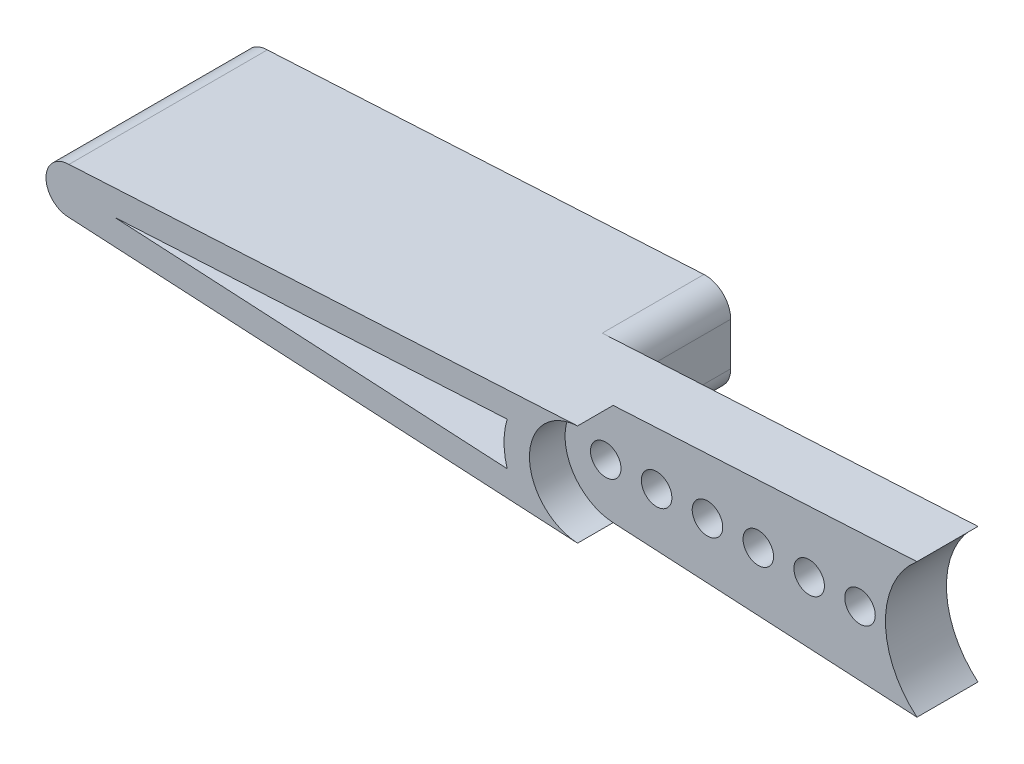
ISO-10303-21;
HEADER;
FILE_DESCRIPTION(('STEP AP214'),'2;1');
FILE_NAME('part.step','',(''),(''),'','','');
FILE_SCHEMA(('AUTOMOTIVE_DESIGN { 1 0 10303 214 1 1 1 1 }'));
ENDSEC;
DATA;
#1=APPLICATION_CONTEXT('core data for automotive mechanical design processes');
#2=APPLICATION_PROTOCOL_DEFINITION('international standard','automotive_design',2000,#1);
#3=PRODUCT_CONTEXT('',#1,'mechanical');
#4=PRODUCT('Part','Part','',(#3));
#5=PRODUCT_RELATED_PRODUCT_CATEGORY('part','',(#4));
#6=PRODUCT_DEFINITION_FORMATION('','',#4);
#7=PRODUCT_DEFINITION_CONTEXT('part definition',#1,'design');
#8=PRODUCT_DEFINITION('design','',#6,#7);
#9=PRODUCT_DEFINITION_SHAPE('','',#8);
#10=(LENGTH_UNIT() NAMED_UNIT(*) SI_UNIT(.MILLI.,.METRE.));
#11=(NAMED_UNIT(*) PLANE_ANGLE_UNIT() SI_UNIT($,.RADIAN.));
#12=(NAMED_UNIT(*) SI_UNIT($,.STERADIAN.) SOLID_ANGLE_UNIT());
#13=UNCERTAINTY_MEASURE_WITH_UNIT(LENGTH_MEASURE(1.E-05),#10,'distance_accuracy_value','');
#14=(GEOMETRIC_REPRESENTATION_CONTEXT(3) GLOBAL_UNCERTAINTY_ASSIGNED_CONTEXT((#13)) GLOBAL_UNIT_ASSIGNED_CONTEXT((#10,
#11,#12)) REPRESENTATION_CONTEXT('',''));
#15=CARTESIAN_POINT('',(0.,0.,0.));
#16=DIRECTION('',(0.,0.,1.));
#17=DIRECTION('',(1.,0.,0.));
#18=AXIS2_PLACEMENT_3D('',#15,#16,#17);
#19=CARTESIAN_POINT('',(0.,0.,0.));
#20=DIRECTION('',(0.,0.,1.));
#21=DIRECTION('',(1.,0.,0.));
#22=AXIS2_PLACEMENT_3D('',#19,#20,#21);
#23=PLANE('',#22);
#24=CARTESIAN_POINT('',(-11.,0.,0.));
#25=DIRECTION('',(0.,0.,1.));
#26=DIRECTION('',(1.,0.,0.));
#27=AXIS2_PLACEMENT_3D('',#24,#25,#26);
#28=CIRCLE('',#27,0.600000000000013);
#29=CARTESIAN_POINT('',(-10.4,0.,0.));
#30=VERTEX_POINT('',#29);
#31=EDGE_CURVE('E311',#30,#30,#28,.T.);
#32=ORIENTED_EDGE('',*,*,#31,.T.);
#33=EDGE_LOOP('',(#32));
#34=FACE_BOUND('',#33,.T.);
#35=CARTESIAN_POINT('',(-9.,0.,0.));
#36=DIRECTION('',(0.,0.,1.));
#37=DIRECTION('',(1.,0.,0.));
#38=AXIS2_PLACEMENT_3D('',#35,#36,#37);
#39=CIRCLE('',#38,0.600000000000013);
#40=CARTESIAN_POINT('',(-8.39999999999999,0.,0.));
#41=VERTEX_POINT('',#40);
#42=EDGE_CURVE('E307',#41,#41,#39,.T.);
#43=ORIENTED_EDGE('',*,*,#42,.T.);
#44=EDGE_LOOP('',(#43));
#45=FACE_BOUND('',#44,.T.);
#46=CARTESIAN_POINT('',(-7.,0.,0.));
#47=DIRECTION('',(0.,0.,1.));
#48=DIRECTION('',(1.,0.,0.));
#49=AXIS2_PLACEMENT_3D('',#46,#47,#48);
#50=CIRCLE('',#49,0.600000000000013);
#51=CARTESIAN_POINT('',(-6.39999999999999,0.,0.));
#52=VERTEX_POINT('',#51);
#53=EDGE_CURVE('E303',#52,#52,#50,.T.);
#54=ORIENTED_EDGE('',*,*,#53,.T.);
#55=EDGE_LOOP('',(#54));
#56=FACE_BOUND('',#55,.T.);
#57=CARTESIAN_POINT('',(-5.,0.,0.));
#58=DIRECTION('',(0.,0.,1.));
#59=DIRECTION('',(1.,0.,0.));
#60=AXIS2_PLACEMENT_3D('',#57,#58,#59);
#61=CIRCLE('',#60,0.600000000000013);
#62=CARTESIAN_POINT('',(-4.39999999999999,0.,0.));
#63=VERTEX_POINT('',#62);
#64=EDGE_CURVE('E299',#63,#63,#61,.T.);
#65=ORIENTED_EDGE('',*,*,#64,.T.);
#66=EDGE_LOOP('',(#65));
#67=FACE_BOUND('',#66,.T.);
#68=CARTESIAN_POINT('',(-3.,0.,0.));
#69=DIRECTION('',(0.,0.,1.));
#70=DIRECTION('',(1.,0.,0.));
#71=AXIS2_PLACEMENT_3D('',#68,#69,#70);
#72=CIRCLE('',#71,0.600000000000013);
#73=CARTESIAN_POINT('',(-2.39999999999999,0.,0.));
#74=VERTEX_POINT('',#73);
#75=EDGE_CURVE('E295',#74,#74,#72,.T.);
#76=ORIENTED_EDGE('',*,*,#75,.T.);
#77=EDGE_LOOP('',(#76));
#78=FACE_BOUND('',#77,.T.);
#79=CARTESIAN_POINT('',(-0.999999999999999,0.,0.));
#80=DIRECTION('',(0.,0.,1.));
#81=DIRECTION('',(1.,0.,0.));
#82=AXIS2_PLACEMENT_3D('',#79,#80,#81);
#83=CIRCLE('',#82,0.600000000000013);
#84=CARTESIAN_POINT('',(-0.399999999999986,0.,0.));
#85=VERTEX_POINT('',#84);
#86=EDGE_CURVE('E148',#85,#85,#83,.T.);
#87=ORIENTED_EDGE('',*,*,#86,.T.);
#88=EDGE_LOOP('',(#87));
#89=FACE_BOUND('',#88,.T.);
#90=DIRECTION('',(0.,1.,0.));
#91=VECTOR('',#90,1.);
#92=CARTESIAN_POINT('',(-12.4846831030102,0.,0.));
#93=LINE('',#92,#91);
#94=CARTESIAN_POINT('',(-12.4846831030102,-0.843865841434121,0.));
#95=VERTEX_POINT('',#94);
#96=CARTESIAN_POINT('',(-12.4846831030102,0.84386584143412,0.));
#97=VERTEX_POINT('',#96);
#98=EDGE_CURVE('E57',#95,#97,#93,.T.);
#99=ORIENTED_EDGE('',*,*,#98,.T.);
#100=CARTESIAN_POINT('',(-13.4846831030102,0.84386584143412,0.));
#101=DIRECTION('',(0.,0.,-1.));
#102=DIRECTION('',(-1.,0.,0.));
#103=AXIS2_PLACEMENT_3D('',#100,#101,#102);
#104=CIRCLE('',#103,1.);
#105=CARTESIAN_POINT('',(-13.5392440865313,1.84237628157844,0.));
#106=VERTEX_POINT('',#105);
#107=EDGE_CURVE('E165',#97,#106,#104,.F.);
#108=ORIENTED_EDGE('',*,*,#107,.T.);
#109=DIRECTION('',(-0.998510440144325,-0.0545609835210726,0.));
#110=VECTOR('',#109,1.);
#111=CARTESIAN_POINT('',(-0.140677116823685,2.57450582399418,0.));
#112=LINE('',#111,#110);
#113=CARTESIAN_POINT('',(1.24092779656255,2.65,0.));
#114=VERTEX_POINT('',#113);
#115=EDGE_CURVE('E315',#114,#106,#112,.T.);
#116=ORIENTED_EDGE('',*,*,#115,.F.);
#117=CARTESIAN_POINT('',(3.45,0.,0.));
#118=DIRECTION('',(0.,0.,1.));
#119=DIRECTION('',(1.,0.,0.));
#120=AXIS2_PLACEMENT_3D('',#117,#118,#119);
#121=CIRCLE('',#120,3.45);
#122=CARTESIAN_POINT('',(1.24092779656255,-2.65,0.));
#123=VERTEX_POINT('',#122);
#124=EDGE_CURVE('E259',#114,#123,#121,.T.);
#125=ORIENTED_EDGE('',*,*,#124,.T.);
#126=DIRECTION('',(0.998510440144325,-0.0545609835210729,0.));
#127=VECTOR('',#126,1.);
#128=CARTESIAN_POINT('',(-0.140677116823685,-2.57450582399419,0.));
#129=LINE('',#128,#127);
#130=CARTESIAN_POINT('',(-13.5392440865313,-1.84237628157844,0.));
#131=VERTEX_POINT('',#130);
#132=EDGE_CURVE('E319',#131,#123,#129,.T.);
#133=ORIENTED_EDGE('',*,*,#132,.F.);
#134=CARTESIAN_POINT('',(-13.4846831030102,-0.843865841434122,0.));
#135=DIRECTION('',(0.,0.,-1.));
#136=DIRECTION('',(-1.,0.,0.));
#137=AXIS2_PLACEMENT_3D('',#134,#135,#136);
#138=CIRCLE('',#137,1.);
#139=EDGE_CURVE('E62',#95,#131,#138,.T.);
#140=ORIENTED_EDGE('',*,*,#139,.F.);
#141=EDGE_LOOP('',(#99,#108,#116,#125,#133,#140));
#142=FACE_BOUND('',#141,.T.);
#143=ADVANCED_FACE('F41',(#34,#45,#56,#67,#78,#89,#142),#23,.F.);
#144=CARTESIAN_POINT('',(-0.140677116823685,2.57450582399418,2.4));
#145=DIRECTION('',(0.0545609835210726,-0.998510440144325,0.));
#146=DIRECTION('',(0.998510440144325,0.0545609835210726,0.));
#147=AXIS2_PLACEMENT_3D('',#144,#145,#146);
#148=PLANE('',#147);
#149=ORIENTED_EDGE('',*,*,#115,.T.);
#150=DIRECTION('',(0.,0.,1.));
#151=VECTOR('',#150,1.);
#152=CARTESIAN_POINT('',(-13.5392440865313,1.84237628157844,-4.));
#153=LINE('',#152,#151);
#154=CARTESIAN_POINT('',(-13.5392440865313,1.84237628157844,-4.));
#155=VERTEX_POINT('',#154);
#156=EDGE_CURVE('E202',#155,#106,#153,.T.);
#157=ORIENTED_EDGE('',*,*,#156,.F.);
#158=DIRECTION('',(0.998510440144325,0.0545609835210726,0.));
#159=VECTOR('',#158,1.);
#160=CARTESIAN_POINT('',(-0.140677116823685,2.57450582399418,-4.));
#161=LINE('',#160,#159);
#162=CARTESIAN_POINT('',(-30.7114062880559,0.904048527325677,-4.));
#163=VERTEX_POINT('',#162);
#164=EDGE_CURVE('E188',#163,#155,#161,.T.);
#165=ORIENTED_EDGE('',*,*,#164,.F.);
#166=DIRECTION('',(0.,0.,-1.));
#167=VECTOR('',#166,1.);
#168=CARTESIAN_POINT('',(-30.7114062880559,0.904048527325677,3.8));
#169=LINE('',#168,#167);
#170=CARTESIAN_POINT('',(-30.7114062880559,0.904048527325677,3.8));
#171=VERTEX_POINT('',#170);
#172=EDGE_CURVE('E239',#171,#163,#169,.T.);
#173=ORIENTED_EDGE('',*,*,#172,.F.);
#174=DIRECTION('',(-0.998510440144325,-0.0545609835210725,0.));
#175=VECTOR('',#174,1.);
#176=CARTESIAN_POINT('',(-0.140677116823685,2.57450582399418,3.8));
#177=LINE('',#176,#175);
#178=CARTESIAN_POINT('',(-10.7091219670421,1.99702088028865,3.8));
#179=VERTEX_POINT('',#178);
#180=EDGE_CURVE('E213',#179,#171,#177,.T.);
#181=ORIENTED_EDGE('',*,*,#180,.F.);
#182=DIRECTION('',(0.,0.,-1.));
#183=VECTOR('',#182,1.);
#184=CARTESIAN_POINT('',(-10.7091219670421,1.99702088028865,3.8));
#185=LINE('',#184,#183);
#186=CARTESIAN_POINT('',(-10.7091219670421,1.99702088028865,2.4));
#187=VERTEX_POINT('',#186);
#188=EDGE_CURVE('E236',#179,#187,#185,.T.);
#189=ORIENTED_EDGE('',*,*,#188,.T.);
#190=DIRECTION('',(-0.998510440144325,-0.0545609835210726,0.));
#191=VECTOR('',#190,1.);
#192=CARTESIAN_POINT('',(-0.140677116823685,2.57450582399418,2.4));
#193=LINE('',#192,#191);
#194=CARTESIAN_POINT('',(1.24092779656255,2.65,2.4));
#195=VERTEX_POINT('',#194);
#196=EDGE_CURVE('E279',#195,#187,#193,.T.);
#197=ORIENTED_EDGE('',*,*,#196,.F.);
#198=DIRECTION('',(0.,0.,-1.));
#199=VECTOR('',#198,1.);
#200=CARTESIAN_POINT('',(1.24092779656255,2.65,2.4));
#201=LINE('',#200,#199);
#202=EDGE_CURVE('E50',#195,#114,#201,.T.);
#203=ORIENTED_EDGE('',*,*,#202,.T.);
#204=EDGE_LOOP('',(#149,#157,#165,#173,#181,#189,#197,#203));
#205=FACE_BOUND('',#204,.T.);
#206=ADVANCED_FACE('F328',(#205),#148,.F.);
#207=CARTESIAN_POINT('',(-0.140677116823685,-2.57450582399419,2.4));
#208=DIRECTION('',(0.0545609835210728,0.998510440144325,0.));
#209=DIRECTION('',(-0.998510440144325,0.0545609835210728,0.));
#210=AXIS2_PLACEMENT_3D('',#207,#208,#209);
#211=PLANE('',#210);
#212=DIRECTION('',(0.,0.,-1.));
#213=VECTOR('',#212,1.);
#214=CARTESIAN_POINT('',(-30.7114062880559,-0.904048527325679,3.8));
#215=LINE('',#214,#213);
#216=CARTESIAN_POINT('',(-30.7114062880559,-0.904048527325679,3.8));
#217=VERTEX_POINT('',#216);
#218=CARTESIAN_POINT('',(-30.7114062880559,-0.904048527325678,-4.));
#219=VERTEX_POINT('',#218);
#220=EDGE_CURVE('E249',#217,#219,#215,.T.);
#221=ORIENTED_EDGE('',*,*,#220,.T.);
#222=DIRECTION('',(-0.998510440144325,0.0545609835210729,0.));
#223=VECTOR('',#222,1.);
#224=CARTESIAN_POINT('',(-0.140677116823685,-2.57450582399419,-4.));
#225=LINE('',#224,#223);
#226=CARTESIAN_POINT('',(-13.5392440865313,-1.84237628157844,-4.));
#227=VERTEX_POINT('',#226);
#228=EDGE_CURVE('E180',#227,#219,#225,.T.);
#229=ORIENTED_EDGE('',*,*,#228,.F.);
#230=DIRECTION('',(0.,0.,1.));
#231=VECTOR('',#230,1.);
#232=CARTESIAN_POINT('',(-13.5392440865313,-1.84237628157844,-4.));
#233=LINE('',#232,#231);
#234=EDGE_CURVE('E206',#227,#131,#233,.T.);
#235=ORIENTED_EDGE('',*,*,#234,.T.);
#236=ORIENTED_EDGE('',*,*,#132,.T.);
#237=DIRECTION('',(0.,0.,-1.));
#238=VECTOR('',#237,1.);
#239=CARTESIAN_POINT('',(1.24092779656255,-2.65,2.4));
#240=LINE('',#239,#238);
#241=CARTESIAN_POINT('',(1.24092779656255,-2.65,2.4));
#242=VERTEX_POINT('',#241);
#243=EDGE_CURVE('E11',#242,#123,#240,.T.);
#244=ORIENTED_EDGE('',*,*,#243,.F.);
#245=DIRECTION('',(0.998510440144325,-0.0545609835210729,0.));
#246=VECTOR('',#245,1.);
#247=CARTESIAN_POINT('',(-0.140677116823685,-2.57450582399419,2.4));
#248=LINE('',#247,#246);
#249=CARTESIAN_POINT('',(-10.7091219670421,-1.99702088028865,2.4));
#250=VERTEX_POINT('',#249);
#251=EDGE_CURVE('E285',#250,#242,#248,.T.);
#252=ORIENTED_EDGE('',*,*,#251,.F.);
#253=DIRECTION('',(0.,0.,-1.));
#254=VECTOR('',#253,1.);
#255=CARTESIAN_POINT('',(-10.7091219670421,-1.99702088028865,3.8));
#256=LINE('',#255,#254);
#257=CARTESIAN_POINT('',(-10.7091219670421,-1.99702088028865,3.8));
#258=VERTEX_POINT('',#257);
#259=EDGE_CURVE('E245',#258,#250,#256,.T.);
#260=ORIENTED_EDGE('',*,*,#259,.F.);
#261=DIRECTION('',(-0.998510440144325,0.0545609835210724,0.));
#262=VECTOR('',#261,1.);
#263=CARTESIAN_POINT('',(-0.140677116823684,-2.57450582399418,3.8));
#264=LINE('',#263,#262);
#265=EDGE_CURVE('E220',#258,#217,#264,.T.);
#266=ORIENTED_EDGE('',*,*,#265,.T.);
#267=EDGE_LOOP('',(#221,#229,#235,#236,#244,#252,#260,#266));
#268=FACE_BOUND('',#267,.T.);
#269=ADVANCED_FACE('F338',(#268),#211,.F.);
#270=CARTESIAN_POINT('',(-11.,0.,2.4));
#271=DIRECTION('',(0.,0.,-1.));
#272=DIRECTION('',(-1.,0.,0.));
#273=AXIS2_PLACEMENT_3D('',#270,#271,#272);
#274=CYLINDRICAL_SURFACE('',#273,0.600000000000013);
#275=CARTESIAN_POINT('',(-11.,0.,2.4));
#276=DIRECTION('',(0.,0.,1.));
#277=DIRECTION('',(1.,0.,0.));
#278=AXIS2_PLACEMENT_3D('',#275,#276,#277);
#279=CIRCLE('',#278,0.600000000000013);
#280=CARTESIAN_POINT('',(-10.4,0.,2.4));
#281=VERTEX_POINT('',#280);
#282=EDGE_CURVE('E275',#281,#281,#279,.T.);
#283=ORIENTED_EDGE('',*,*,#282,.T.);
#284=EDGE_LOOP('',(#283));
#285=FACE_BOUND('',#284,.T.);
#286=ORIENTED_EDGE('',*,*,#31,.F.);
#287=EDGE_LOOP('',(#286));
#288=FACE_BOUND('',#287,.T.);
#289=ADVANCED_FACE('F388',(#285,#288),#274,.F.);
#290=CARTESIAN_POINT('',(-9.,0.,2.4));
#291=DIRECTION('',(0.,0.,-1.));
#292=DIRECTION('',(-1.,0.,0.));
#293=AXIS2_PLACEMENT_3D('',#290,#291,#292);
#294=CYLINDRICAL_SURFACE('',#293,0.600000000000013);
#295=CARTESIAN_POINT('',(-9.,0.,2.4));
#296=DIRECTION('',(0.,0.,1.));
#297=DIRECTION('',(1.,0.,0.));
#298=AXIS2_PLACEMENT_3D('',#295,#296,#297);
#299=CIRCLE('',#298,0.600000000000013);
#300=CARTESIAN_POINT('',(-8.39999999999999,0.,2.4));
#301=VERTEX_POINT('',#300);
#302=EDGE_CURVE('E271',#301,#301,#299,.T.);
#303=ORIENTED_EDGE('',*,*,#302,.T.);
#304=EDGE_LOOP('',(#303));
#305=FACE_BOUND('',#304,.T.);
#306=ORIENTED_EDGE('',*,*,#42,.F.);
#307=EDGE_LOOP('',(#306));
#308=FACE_BOUND('',#307,.T.);
#309=ADVANCED_FACE('F392',(#305,#308),#294,.F.);
#310=CARTESIAN_POINT('',(-7.,0.,2.4));
#311=DIRECTION('',(0.,0.,-1.));
#312=DIRECTION('',(-1.,0.,0.));
#313=AXIS2_PLACEMENT_3D('',#310,#311,#312);
#314=CYLINDRICAL_SURFACE('',#313,0.600000000000013);
#315=CARTESIAN_POINT('',(-7.,0.,2.4));
#316=DIRECTION('',(0.,0.,1.));
#317=DIRECTION('',(1.,0.,0.));
#318=AXIS2_PLACEMENT_3D('',#315,#316,#317);
#319=CIRCLE('',#318,0.600000000000013);
#320=CARTESIAN_POINT('',(-6.39999999999999,0.,2.4));
#321=VERTEX_POINT('',#320);
#322=EDGE_CURVE('E267',#321,#321,#319,.T.);
#323=ORIENTED_EDGE('',*,*,#322,.T.);
#324=EDGE_LOOP('',(#323));
#325=FACE_BOUND('',#324,.T.);
#326=ORIENTED_EDGE('',*,*,#53,.F.);
#327=EDGE_LOOP('',(#326));
#328=FACE_BOUND('',#327,.T.);
#329=ADVANCED_FACE('F396',(#325,#328),#314,.F.);
#330=CARTESIAN_POINT('',(-5.,0.,2.4));
#331=DIRECTION('',(0.,0.,-1.));
#332=DIRECTION('',(-1.,0.,0.));
#333=AXIS2_PLACEMENT_3D('',#330,#331,#332);
#334=CYLINDRICAL_SURFACE('',#333,0.600000000000013);
#335=CARTESIAN_POINT('',(-5.,0.,2.4));
#336=DIRECTION('',(0.,0.,1.));
#337=DIRECTION('',(1.,0.,0.));
#338=AXIS2_PLACEMENT_3D('',#335,#336,#337);
#339=CIRCLE('',#338,0.600000000000013);
#340=CARTESIAN_POINT('',(-4.39999999999999,0.,2.4));
#341=VERTEX_POINT('',#340);
#342=EDGE_CURVE('E263',#341,#341,#339,.T.);
#343=ORIENTED_EDGE('',*,*,#342,.T.);
#344=EDGE_LOOP('',(#343));
#345=FACE_BOUND('',#344,.T.);
#346=ORIENTED_EDGE('',*,*,#64,.F.);
#347=EDGE_LOOP('',(#346));
#348=FACE_BOUND('',#347,.T.);
#349=ADVANCED_FACE('F400',(#345,#348),#334,.F.);
#350=CARTESIAN_POINT('',(-3.,0.,2.4));
#351=DIRECTION('',(0.,0.,-1.));
#352=DIRECTION('',(-1.,0.,0.));
#353=AXIS2_PLACEMENT_3D('',#350,#351,#352);
#354=CYLINDRICAL_SURFACE('',#353,0.600000000000013);
#355=CARTESIAN_POINT('',(-3.,0.,2.4));
#356=DIRECTION('',(0.,0.,1.));
#357=DIRECTION('',(1.,0.,0.));
#358=AXIS2_PLACEMENT_3D('',#355,#356,#357);
#359=CIRCLE('',#358,0.600000000000013);
#360=CARTESIAN_POINT('',(-2.39999999999999,0.,2.4));
#361=VERTEX_POINT('',#360);
#362=EDGE_CURVE('E258',#361,#361,#359,.T.);
#363=ORIENTED_EDGE('',*,*,#362,.T.);
#364=EDGE_LOOP('',(#363));
#365=FACE_BOUND('',#364,.T.);
#366=ORIENTED_EDGE('',*,*,#75,.F.);
#367=EDGE_LOOP('',(#366));
#368=FACE_BOUND('',#367,.T.);
#369=ADVANCED_FACE('F403',(#365,#368),#354,.F.);
#370=CARTESIAN_POINT('',(-0.999999999999999,0.,2.4));
#371=DIRECTION('',(0.,0.,-1.));
#372=DIRECTION('',(-1.,0.,0.));
#373=AXIS2_PLACEMENT_3D('',#370,#371,#372);
#374=CYLINDRICAL_SURFACE('',#373,0.600000000000013);
#375=CARTESIAN_POINT('',(-0.999999999999999,0.,2.4));
#376=DIRECTION('',(0.,0.,1.));
#377=DIRECTION('',(1.,0.,0.));
#378=AXIS2_PLACEMENT_3D('',#375,#376,#377);
#379=CIRCLE('',#378,0.600000000000013);
#380=CARTESIAN_POINT('',(-0.399999999999986,0.,2.4));
#381=VERTEX_POINT('',#380);
#382=EDGE_CURVE('E254',#381,#381,#379,.T.);
#383=ORIENTED_EDGE('',*,*,#382,.T.);
#384=EDGE_LOOP('',(#383));
#385=FACE_BOUND('',#384,.T.);
#386=ORIENTED_EDGE('',*,*,#86,.F.);
#387=EDGE_LOOP('',(#386));
#388=FACE_BOUND('',#387,.T.);
#389=ADVANCED_FACE('F43',(#385,#388),#374,.F.);
#390=CARTESIAN_POINT('',(3.45,0.,2.4));
#391=DIRECTION('',(0.,0.,-1.));
#392=DIRECTION('',(-1.,0.,0.));
#393=AXIS2_PLACEMENT_3D('',#390,#391,#392);
#394=CYLINDRICAL_SURFACE('',#393,3.45);
#395=ORIENTED_EDGE('',*,*,#124,.F.);
#396=ORIENTED_EDGE('',*,*,#202,.F.);
#397=CARTESIAN_POINT('',(3.45,0.,2.4));
#398=DIRECTION('',(0.,0.,1.));
#399=DIRECTION('',(1.,0.,0.));
#400=AXIS2_PLACEMENT_3D('',#397,#398,#399);
#401=CIRCLE('',#400,3.45);
#402=EDGE_CURVE('E288',#195,#242,#401,.T.);
#403=ORIENTED_EDGE('',*,*,#402,.T.);
#404=ORIENTED_EDGE('',*,*,#243,.T.);
#405=EDGE_LOOP('',(#395,#396,#403,#404));
#406=FACE_BOUND('',#405,.T.);
#407=ADVANCED_FACE('F334',(#406),#394,.F.);
#408=CARTESIAN_POINT('',(0.,0.,2.4));
#409=DIRECTION('',(0.,0.,1.));
#410=DIRECTION('',(1.,0.,0.));
#411=AXIS2_PLACEMENT_3D('',#408,#409,#410);
#412=PLANE('',#411);
#413=ORIENTED_EDGE('',*,*,#382,.F.);
#414=EDGE_LOOP('',(#413));
#415=FACE_BOUND('',#414,.T.);
#416=ORIENTED_EDGE('',*,*,#362,.F.);
#417=EDGE_LOOP('',(#416));
#418=FACE_BOUND('',#417,.T.);
#419=ORIENTED_EDGE('',*,*,#342,.F.);
#420=EDGE_LOOP('',(#419));
#421=FACE_BOUND('',#420,.T.);
#422=ORIENTED_EDGE('',*,*,#322,.F.);
#423=EDGE_LOOP('',(#422));
#424=FACE_BOUND('',#423,.T.);
#425=ORIENTED_EDGE('',*,*,#302,.F.);
#426=EDGE_LOOP('',(#425));
#427=FACE_BOUND('',#426,.T.);
#428=ORIENTED_EDGE('',*,*,#282,.F.);
#429=EDGE_LOOP('',(#428));
#430=FACE_BOUND('',#429,.T.);
#431=ORIENTED_EDGE('',*,*,#196,.T.);
#432=CARTESIAN_POINT('',(-10.6,0.,2.4));
#433=DIRECTION('',(0.,0.,1.));
#434=DIRECTION('',(1.,0.,0.));
#435=AXIS2_PLACEMENT_3D('',#432,#433,#434);
#436=CIRCLE('',#435,2.);
#437=EDGE_CURVE('E282',#187,#250,#436,.T.);
#438=ORIENTED_EDGE('',*,*,#437,.T.);
#439=ORIENTED_EDGE('',*,*,#251,.T.);
#440=ORIENTED_EDGE('',*,*,#402,.F.);
#441=EDGE_LOOP('',(#431,#438,#439,#440));
#442=FACE_BOUND('',#441,.T.);
#443=ADVANCED_FACE('F365',(#415,#418,#421,#424,#427,#430,#442),#412,.T.);
#444=CARTESIAN_POINT('',(-0.0861161333026121,1.57599538384986,3.8));
#445=DIRECTION('',(0.0545609835210725,-0.998510440144325,0.));
#446=DIRECTION('',(0.998510440144325,0.0545609835210725,0.));
#447=AXIS2_PLACEMENT_3D('',#444,#445,#446);
#448=PLANE('',#447);
#449=DIRECTION('',(0.,0.,-1.));
#450=VECTOR('',#449,1.);
#451=CARTESIAN_POINT('',(-28.9281153576306,0.,3.8));
#452=LINE('',#451,#450);
#453=CARTESIAN_POINT('',(-28.9281153576306,0.,3.8));
#454=VERTEX_POINT('',#453);
#455=CARTESIAN_POINT('',(-28.9281153576306,0.,-4.));
#456=VERTEX_POINT('',#455);
#457=EDGE_CURVE('E155',#454,#456,#452,.T.);
#458=ORIENTED_EDGE('',*,*,#457,.T.);
#459=DIRECTION('',(-0.998510440144325,-0.0545609835210726,0.));
#460=VECTOR('',#459,1.);
#461=CARTESIAN_POINT('',(-0.0861161333026121,1.57599538384986,-4.));
#462=LINE('',#461,#460);
#463=CARTESIAN_POINT('',(-13.4787749967675,0.844188674400492,-4.));
#464=VERTEX_POINT('',#463);
#465=EDGE_CURVE('E152',#464,#456,#462,.T.);
#466=ORIENTED_EDGE('',*,*,#465,.F.);
#467=DIRECTION('',(0.,0.,-1.));
#468=VECTOR('',#467,1.);
#469=CARTESIAN_POINT('',(-13.4787749967675,0.844188674400493,3.8));
#470=LINE('',#469,#468);
#471=CARTESIAN_POINT('',(-13.4787749967675,0.844188674400493,3.8));
#472=VERTEX_POINT('',#471);
#473=EDGE_CURVE('E136',#472,#464,#470,.T.);
#474=ORIENTED_EDGE('',*,*,#473,.F.);
#475=DIRECTION('',(-0.998510440144325,-0.0545609835210726,0.));
#476=VECTOR('',#475,1.);
#477=CARTESIAN_POINT('',(-0.0861161333026121,1.57599538384986,3.8));
#478=LINE('',#477,#476);
#479=EDGE_CURVE('E228',#472,#454,#478,.T.);
#480=ORIENTED_EDGE('',*,*,#479,.T.);
#481=EDGE_LOOP('',(#458,#466,#474,#480));
#482=FACE_BOUND('',#481,.T.);
#483=ADVANCED_FACE('F153',(#482),#448,.T.);
#484=CARTESIAN_POINT('',(-10.6,0.,3.8));
#485=DIRECTION('',(0.,0.,-1.));
#486=DIRECTION('',(-1.,0.,0.));
#487=AXIS2_PLACEMENT_3D('',#484,#485,#486);
#488=CYLINDRICAL_SURFACE('',#487,3.);
#489=ORIENTED_EDGE('',*,*,#473,.T.);
#490=CARTESIAN_POINT('',(-10.6,0.,-4.));
#491=DIRECTION('',(0.,0.,-1.));
#492=DIRECTION('',(-1.,0.,0.));
#493=AXIS2_PLACEMENT_3D('',#490,#491,#492);
#494=CIRCLE('',#493,3.);
#495=CARTESIAN_POINT('',(-13.4787749967675,-0.844188674400491,-4.));
#496=VERTEX_POINT('',#495);
#497=EDGE_CURVE('E141',#496,#464,#494,.T.);
#498=ORIENTED_EDGE('',*,*,#497,.F.);
#499=DIRECTION('',(0.,0.,-1.));
#500=VECTOR('',#499,1.);
#501=CARTESIAN_POINT('',(-13.4787749967675,-0.844188674400492,3.8));
#502=LINE('',#501,#500);
#503=CARTESIAN_POINT('',(-13.4787749967675,-0.844188674400492,3.8));
#504=VERTEX_POINT('',#503);
#505=EDGE_CURVE('E149',#504,#496,#502,.T.);
#506=ORIENTED_EDGE('',*,*,#505,.F.);
#507=CARTESIAN_POINT('',(-10.6,0.,3.8));
#508=DIRECTION('',(0.,0.,1.));
#509=DIRECTION('',(1.,0.,0.));
#510=AXIS2_PLACEMENT_3D('',#507,#508,#509);
#511=CIRCLE('',#510,3.);
#512=EDGE_CURVE('E143',#472,#504,#511,.T.);
#513=ORIENTED_EDGE('',*,*,#512,.F.);
#514=EDGE_LOOP('',(#489,#498,#506,#513));
#515=FACE_BOUND('',#514,.T.);
#516=ADVANCED_FACE('F138',(#515),#488,.T.);
#517=CARTESIAN_POINT('',(-30.7114062880558,0.,3.8));
#518=DIRECTION('',(0.,0.,-1.));
#519=DIRECTION('',(-1.,0.,0.));
#520=AXIS2_PLACEMENT_3D('',#517,#518,#519);
#521=CYLINDRICAL_SURFACE('',#520,0.904048527325678);
#522=ORIENTED_EDGE('',*,*,#172,.T.);
#523=CARTESIAN_POINT('',(-30.7114062880558,0.,-4.));
#524=DIRECTION('',(0.,0.,-1.));
#525=DIRECTION('',(-1.,0.,0.));
#526=AXIS2_PLACEMENT_3D('',#523,#524,#525);
#527=CIRCLE('',#526,0.904048527325678);
#528=EDGE_CURVE('E184',#219,#163,#527,.T.);
#529=ORIENTED_EDGE('',*,*,#528,.F.);
#530=ORIENTED_EDGE('',*,*,#220,.F.);
#531=CARTESIAN_POINT('',(-30.7114062880558,0.,3.8));
#532=DIRECTION('',(0.,0.,1.));
#533=DIRECTION('',(1.,0.,0.));
#534=AXIS2_PLACEMENT_3D('',#531,#532,#533);
#535=CIRCLE('',#534,0.904048527325678);
#536=EDGE_CURVE('E217',#171,#217,#535,.T.);
#537=ORIENTED_EDGE('',*,*,#536,.F.);
#538=EDGE_LOOP('',(#522,#529,#530,#537));
#539=FACE_BOUND('',#538,.T.);
#540=ADVANCED_FACE('F355',(#539),#521,.T.);
#541=CARTESIAN_POINT('',(-10.6,0.,3.8));
#542=DIRECTION('',(0.,0.,-1.));
#543=DIRECTION('',(-1.,0.,0.));
#544=AXIS2_PLACEMENT_3D('',#541,#542,#543);
#545=CYLINDRICAL_SURFACE('',#544,2.);
#546=ORIENTED_EDGE('',*,*,#259,.T.);
#547=ORIENTED_EDGE('',*,*,#437,.F.);
#548=ORIENTED_EDGE('',*,*,#188,.F.);
#549=CARTESIAN_POINT('',(-10.6,0.,3.8));
#550=DIRECTION('',(0.,0.,1.));
#551=DIRECTION('',(1.,0.,0.));
#552=AXIS2_PLACEMENT_3D('',#549,#550,#551);
#553=CIRCLE('',#552,2.);
#554=EDGE_CURVE('E224',#179,#258,#553,.T.);
#555=ORIENTED_EDGE('',*,*,#554,.T.);
#556=EDGE_LOOP('',(#546,#547,#548,#555));
#557=FACE_BOUND('',#556,.T.);
#558=ADVANCED_FACE('F363',(#557),#545,.F.);
#559=CARTESIAN_POINT('',(-0.0861161333026116,-1.57599538384986,3.8));
#560=DIRECTION('',(-0.0545609835210724,-0.998510440144325,0.));
#561=DIRECTION('',(0.998510440144325,-0.0545609835210724,0.));
#562=AXIS2_PLACEMENT_3D('',#559,#560,#561);
#563=PLANE('',#562);
#564=ORIENTED_EDGE('',*,*,#505,.T.);
#565=DIRECTION('',(0.998510440144325,-0.0545609835210724,0.));
#566=VECTOR('',#565,1.);
#567=CARTESIAN_POINT('',(-0.0861161333026116,-1.57599538384985,-4.));
#568=LINE('',#567,#566);
#569=EDGE_CURVE('E160',#456,#496,#568,.T.);
#570=ORIENTED_EDGE('',*,*,#569,.F.);
#571=ORIENTED_EDGE('',*,*,#457,.F.);
#572=DIRECTION('',(-0.998510440144325,0.0545609835210724,0.));
#573=VECTOR('',#572,1.);
#574=CARTESIAN_POINT('',(-0.0861161333026116,-1.57599538384986,3.8));
#575=LINE('',#574,#573);
#576=EDGE_CURVE('E233',#504,#454,#575,.T.);
#577=ORIENTED_EDGE('',*,*,#576,.F.);
#578=EDGE_LOOP('',(#564,#570,#571,#577));
#579=FACE_BOUND('',#578,.T.);
#580=ADVANCED_FACE('F456',(#579),#563,.F.);
#581=CARTESIAN_POINT('',(0.,0.,3.8));
#582=DIRECTION('',(0.,0.,1.));
#583=DIRECTION('',(1.,0.,0.));
#584=AXIS2_PLACEMENT_3D('',#581,#582,#583);
#585=PLANE('',#584);
#586=ORIENTED_EDGE('',*,*,#180,.T.);
#587=ORIENTED_EDGE('',*,*,#536,.T.);
#588=ORIENTED_EDGE('',*,*,#265,.F.);
#589=ORIENTED_EDGE('',*,*,#554,.F.);
#590=EDGE_LOOP('',(#586,#587,#588,#589));
#591=FACE_BOUND('',#590,.T.);
#592=ORIENTED_EDGE('',*,*,#479,.F.);
#593=ORIENTED_EDGE('',*,*,#512,.T.);
#594=ORIENTED_EDGE('',*,*,#576,.T.);
#595=EDGE_LOOP('',(#592,#593,#594));
#596=FACE_BOUND('',#595,.T.);
#597=ADVANCED_FACE('F359',(#591,#596),#585,.T.);
#598=CARTESIAN_POINT('',(-12.4846831030102,0.,-4.));
#599=DIRECTION('',(1.,0.,0.));
#600=DIRECTION('',(0.,0.,-1.));
#601=AXIS2_PLACEMENT_3D('',#598,#599,#600);
#602=PLANE('',#601);
#603=ORIENTED_EDGE('',*,*,#98,.F.);
#604=DIRECTION('',(0.,0.,1.));
#605=VECTOR('',#604,1.);
#606=CARTESIAN_POINT('',(-12.4846831030102,-0.843865841434121,-4.));
#607=LINE('',#606,#605);
#608=CARTESIAN_POINT('',(-12.4846831030102,-0.843865841434121,-4.));
#609=VERTEX_POINT('',#608);
#610=EDGE_CURVE('E210',#609,#95,#607,.T.);
#611=ORIENTED_EDGE('',*,*,#610,.F.);
#612=DIRECTION('',(0.,1.,0.));
#613=VECTOR('',#612,1.);
#614=CARTESIAN_POINT('',(-12.4846831030102,0.,-4.));
#615=LINE('',#614,#613);
#616=CARTESIAN_POINT('',(-12.4846831030102,0.84386584143412,-4.));
#617=VERTEX_POINT('',#616);
#618=EDGE_CURVE('E172',#609,#617,#615,.T.);
#619=ORIENTED_EDGE('',*,*,#618,.T.);
#620=DIRECTION('',(0.,0.,1.));
#621=VECTOR('',#620,1.);
#622=CARTESIAN_POINT('',(-12.4846831030102,0.84386584143412,-4.));
#623=LINE('',#622,#621);
#624=EDGE_CURVE('E195',#617,#97,#623,.T.);
#625=ORIENTED_EDGE('',*,*,#624,.T.);
#626=EDGE_LOOP('',(#603,#611,#619,#625));
#627=FACE_BOUND('',#626,.T.);
#628=ADVANCED_FACE('F345',(#627),#602,.T.);
#629=CARTESIAN_POINT('',(-13.4846831030102,-0.843865841434122,-4.));
#630=DIRECTION('',(0.,0.,1.));
#631=DIRECTION('',(1.,0.,0.));
#632=AXIS2_PLACEMENT_3D('',#629,#630,#631);
#633=CYLINDRICAL_SURFACE('',#632,1.);
#634=ORIENTED_EDGE('',*,*,#139,.T.);
#635=ORIENTED_EDGE('',*,*,#234,.F.);
#636=CARTESIAN_POINT('',(-13.4846831030102,-0.843865841434122,-4.));
#637=DIRECTION('',(0.,0.,-1.));
#638=DIRECTION('',(-1.,0.,0.));
#639=AXIS2_PLACEMENT_3D('',#636,#637,#638);
#640=CIRCLE('',#639,1.);
#641=EDGE_CURVE('E176',#609,#227,#640,.T.);
#642=ORIENTED_EDGE('',*,*,#641,.F.);
#643=ORIENTED_EDGE('',*,*,#610,.T.);
#644=EDGE_LOOP('',(#634,#635,#642,#643));
#645=FACE_BOUND('',#644,.T.);
#646=ADVANCED_FACE('F342',(#645),#633,.T.);
#647=CARTESIAN_POINT('',(-13.4846831030102,0.84386584143412,-4.));
#648=DIRECTION('',(0.,0.,1.));
#649=DIRECTION('',(1.,0.,0.));
#650=AXIS2_PLACEMENT_3D('',#647,#648,#649);
#651=CYLINDRICAL_SURFACE('',#650,1.);
#652=ORIENTED_EDGE('',*,*,#107,.F.);
#653=ORIENTED_EDGE('',*,*,#624,.F.);
#654=CARTESIAN_POINT('',(-13.4846831030102,0.84386584143412,-4.));
#655=DIRECTION('',(0.,0.,-1.));
#656=DIRECTION('',(-1.,0.,0.));
#657=AXIS2_PLACEMENT_3D('',#654,#655,#656);
#658=CIRCLE('',#657,1.);
#659=EDGE_CURVE('E191',#617,#155,#658,.F.);
#660=ORIENTED_EDGE('',*,*,#659,.T.);
#661=ORIENTED_EDGE('',*,*,#156,.T.);
#662=EDGE_LOOP('',(#652,#653,#660,#661));
#663=FACE_BOUND('',#662,.T.);
#664=ADVANCED_FACE('F348',(#663),#651,.T.);
#665=CARTESIAN_POINT('',(0.,0.,-4.));
#666=DIRECTION('',(0.,0.,-1.));
#667=DIRECTION('',(-1.,0.,0.));
#668=AXIS2_PLACEMENT_3D('',#665,#666,#667);
#669=PLANE('',#668);
#670=ORIENTED_EDGE('',*,*,#497,.T.);
#671=ORIENTED_EDGE('',*,*,#465,.T.);
#672=ORIENTED_EDGE('',*,*,#569,.T.);
#673=EDGE_LOOP('',(#670,#671,#672));
#674=FACE_BOUND('',#673,.T.);
#675=ORIENTED_EDGE('',*,*,#618,.F.);
#676=ORIENTED_EDGE('',*,*,#641,.T.);
#677=ORIENTED_EDGE('',*,*,#228,.T.);
#678=ORIENTED_EDGE('',*,*,#528,.T.);
#679=ORIENTED_EDGE('',*,*,#164,.T.);
#680=ORIENTED_EDGE('',*,*,#659,.F.);
#681=EDGE_LOOP('',(#675,#676,#677,#678,#679,#680));
#682=FACE_BOUND('',#681,.T.);
#683=ADVANCED_FACE('F162',(#674,#682),#669,.T.);
#684=CLOSED_SHELL('',(#143,#206,#269,#289,#309,#329,#349,#369,#389,#407,#443,#483,#516,#540,
#558,#580,#597,#628,#646,#664,#683));
#685=MANIFOLD_SOLID_BREP('B2',#684);
#686=ADVANCED_BREP_SHAPE_REPRESENTATION('',(#18,#685),#14);
#687=SHAPE_DEFINITION_REPRESENTATION(#9,#686);
ENDSEC;
END-ISO-10303-21;
